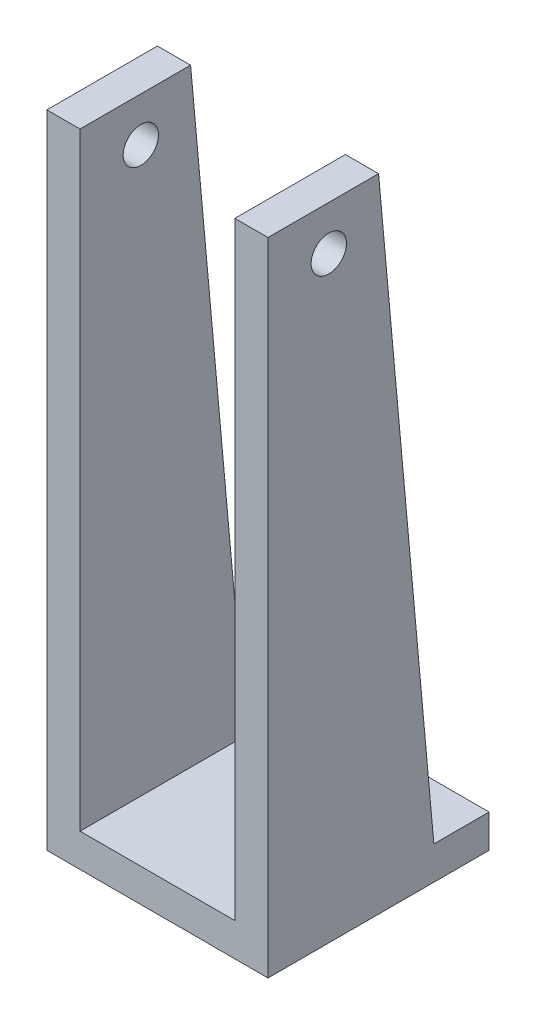
ISO-10303-21;
HEADER;
FILE_DESCRIPTION(('STEP AP214'),'2;1');
FILE_NAME('part.step','',(''),(''),'','','');
FILE_SCHEMA(('AUTOMOTIVE_DESIGN { 1 0 10303 214 1 1 1 1 }'));
ENDSEC;
DATA;
#1=APPLICATION_CONTEXT('core data for automotive mechanical design processes');
#2=APPLICATION_PROTOCOL_DEFINITION('international standard','automotive_design',2000,#1);
#3=PRODUCT_CONTEXT('',#1,'mechanical');
#4=PRODUCT('Part','Part','',(#3));
#5=PRODUCT_RELATED_PRODUCT_CATEGORY('part','',(#4));
#6=PRODUCT_DEFINITION_FORMATION('','',#4);
#7=PRODUCT_DEFINITION_CONTEXT('part definition',#1,'design');
#8=PRODUCT_DEFINITION('design','',#6,#7);
#9=PRODUCT_DEFINITION_SHAPE('','',#8);
#10=(LENGTH_UNIT() NAMED_UNIT(*) SI_UNIT(.MILLI.,.METRE.));
#11=(NAMED_UNIT(*) PLANE_ANGLE_UNIT() SI_UNIT($,.RADIAN.));
#12=(NAMED_UNIT(*) SI_UNIT($,.STERADIAN.) SOLID_ANGLE_UNIT());
#13=UNCERTAINTY_MEASURE_WITH_UNIT(LENGTH_MEASURE(1.E-05),#10,'distance_accuracy_value','');
#14=(GEOMETRIC_REPRESENTATION_CONTEXT(3) GLOBAL_UNCERTAINTY_ASSIGNED_CONTEXT((#13)) GLOBAL_UNIT_ASSIGNED_CONTEXT((#10,
#11,#12)) REPRESENTATION_CONTEXT('',''));
#15=CARTESIAN_POINT('',(0.,0.,0.));
#16=DIRECTION('',(0.,0.,1.));
#17=DIRECTION('',(1.,0.,0.));
#18=AXIS2_PLACEMENT_3D('',#15,#16,#17);
#19=CARTESIAN_POINT('',(-10.,3.,10.));
#20=DIRECTION('',(1.,0.,0.));
#21=DIRECTION('',(0.,0.,-1.));
#22=AXIS2_PLACEMENT_3D('',#19,#20,#21);
#23=PLANE('',#22);
#24=CARTESIAN_POINT('',(-10.,54.,4.5));
#25=DIRECTION('',(1.,0.,0.));
#26=DIRECTION('',(0.,0.,-1.));
#27=AXIS2_PLACEMENT_3D('',#24,#25,#26);
#28=CIRCLE('',#27,1.6);
#29=CARTESIAN_POINT('',(-10.,54.,2.9));
#30=VERTEX_POINT('',#29);
#31=EDGE_CURVE('E227',#30,#30,#28,.T.);
#32=ORIENTED_EDGE('',*,*,#31,.T.);
#33=EDGE_LOOP('',(#32));
#34=FACE_BOUND('',#33,.T.);
#35=DIRECTION('',(0.,0.,1.));
#36=VECTOR('',#35,1.);
#37=CARTESIAN_POINT('',(-10.,0.,10.));
#38=LINE('',#37,#36);
#39=CARTESIAN_POINT('',(-10.,0.,-10.));
#40=VERTEX_POINT('',#39);
#41=CARTESIAN_POINT('',(-10.,0.,10.));
#42=VERTEX_POINT('',#41);
#43=EDGE_CURVE('E166',#40,#42,#38,.T.);
#44=ORIENTED_EDGE('',*,*,#43,.T.);
#45=DIRECTION('',(0.,-1.,0.));
#46=VECTOR('',#45,1.);
#47=CARTESIAN_POINT('',(-10.,3.,10.));
#48=LINE('',#47,#46);
#49=CARTESIAN_POINT('',(-10.,58.,10.));
#50=VERTEX_POINT('',#49);
#51=EDGE_CURVE('E11',#50,#42,#48,.T.);
#52=ORIENTED_EDGE('',*,*,#51,.F.);
#53=DIRECTION('',(0.,0.,-1.));
#54=VECTOR('',#53,1.);
#55=CARTESIAN_POINT('',(-10.,58.,10.));
#56=LINE('',#55,#54);
#57=CARTESIAN_POINT('',(-10.,58.,0.));
#58=VERTEX_POINT('',#57);
#59=EDGE_CURVE('E145',#50,#58,#56,.T.);
#60=ORIENTED_EDGE('',*,*,#59,.T.);
#61=DIRECTION('',(0.,-0.995893206467704,-0.0905357460425185));
#62=VECTOR('',#61,1.);
#63=CARTESIAN_POINT('',(-10.,58.,0.));
#64=LINE('',#63,#62);
#65=CARTESIAN_POINT('',(-10.,3.,-5.));
#66=VERTEX_POINT('',#65);
#67=EDGE_CURVE('E150',#58,#66,#64,.T.);
#68=ORIENTED_EDGE('',*,*,#67,.T.);
#69=DIRECTION('',(0.,0.,1.));
#70=VECTOR('',#69,1.);
#71=CARTESIAN_POINT('',(-10.,3.,10.));
#72=LINE('',#71,#70);
#73=CARTESIAN_POINT('',(-10.,3.,-10.));
#74=VERTEX_POINT('',#73);
#75=EDGE_CURVE('E171',#74,#66,#72,.T.);
#76=ORIENTED_EDGE('',*,*,#75,.F.);
#77=DIRECTION('',(0.,-1.,0.));
#78=VECTOR('',#77,1.);
#79=CARTESIAN_POINT('',(-10.,3.,-10.));
#80=LINE('',#79,#78);
#81=EDGE_CURVE('E180',#74,#40,#80,.T.);
#82=ORIENTED_EDGE('',*,*,#81,.T.);
#83=EDGE_LOOP('',(#44,#52,#60,#68,#76,#82));
#84=FACE_BOUND('',#83,.T.);
#85=ADVANCED_FACE('F37',(#34,#84),#23,.F.);
#86=CARTESIAN_POINT('',(10.,3.,10.));
#87=DIRECTION('',(0.,0.,-1.));
#88=DIRECTION('',(-1.,0.,0.));
#89=AXIS2_PLACEMENT_3D('',#86,#87,#88);
#90=PLANE('',#89);
#91=DIRECTION('',(1.,0.,0.));
#92=VECTOR('',#91,1.);
#93=CARTESIAN_POINT('',(10.,0.,10.));
#94=LINE('',#93,#92);
#95=CARTESIAN_POINT('',(10.,0.,10.));
#96=VERTEX_POINT('',#95);
#97=EDGE_CURVE('E183',#42,#96,#94,.T.);
#98=ORIENTED_EDGE('',*,*,#97,.T.);
#99=DIRECTION('',(0.,-1.,0.));
#100=VECTOR('',#99,1.);
#101=CARTESIAN_POINT('',(10.,3.,10.));
#102=LINE('',#101,#100);
#103=CARTESIAN_POINT('',(10.,58.,10.));
#104=VERTEX_POINT('',#103);
#105=EDGE_CURVE('E45',#104,#96,#102,.T.);
#106=ORIENTED_EDGE('',*,*,#105,.F.);
#107=DIRECTION('',(1.,0.,0.));
#108=VECTOR('',#107,1.);
#109=CARTESIAN_POINT('',(7.,58.,10.));
#110=LINE('',#109,#108);
#111=CARTESIAN_POINT('',(7.,58.,10.));
#112=VERTEX_POINT('',#111);
#113=EDGE_CURVE('E125',#112,#104,#110,.T.);
#114=ORIENTED_EDGE('',*,*,#113,.F.);
#115=DIRECTION('',(0.,-1.,0.));
#116=VECTOR('',#115,1.);
#117=CARTESIAN_POINT('',(7.,58.,10.));
#118=LINE('',#117,#116);
#119=CARTESIAN_POINT('',(7.,3.,10.));
#120=VERTEX_POINT('',#119);
#121=EDGE_CURVE('E136',#112,#120,#118,.T.);
#122=ORIENTED_EDGE('',*,*,#121,.T.);
#123=DIRECTION('',(1.,0.,0.));
#124=VECTOR('',#123,1.);
#125=CARTESIAN_POINT('',(10.,3.,10.));
#126=LINE('',#125,#124);
#127=CARTESIAN_POINT('',(-7.,3.,10.));
#128=VERTEX_POINT('',#127);
#129=EDGE_CURVE('E57',#128,#120,#126,.T.);
#130=ORIENTED_EDGE('',*,*,#129,.F.);
#131=DIRECTION('',(0.,1.,0.));
#132=VECTOR('',#131,1.);
#133=CARTESIAN_POINT('',(-7.,3.,10.));
#134=LINE('',#133,#132);
#135=CARTESIAN_POINT('',(-7.,58.,10.));
#136=VERTEX_POINT('',#135);
#137=EDGE_CURVE('E149',#128,#136,#134,.T.);
#138=ORIENTED_EDGE('',*,*,#137,.T.);
#139=DIRECTION('',(-1.,0.,0.));
#140=VECTOR('',#139,1.);
#141=CARTESIAN_POINT('',(-7.,58.,10.));
#142=LINE('',#141,#140);
#143=EDGE_CURVE('E159',#136,#50,#142,.T.);
#144=ORIENTED_EDGE('',*,*,#143,.T.);
#145=ORIENTED_EDGE('',*,*,#51,.T.);
#146=EDGE_LOOP('',(#98,#106,#114,#122,#130,#138,#144,#145));
#147=FACE_BOUND('',#146,.T.);
#148=ADVANCED_FACE('F218',(#147),#90,.F.);
#149=CARTESIAN_POINT('',(10.,3.,10.));
#150=DIRECTION('',(-1.,0.,0.));
#151=DIRECTION('',(0.,0.,1.));
#152=AXIS2_PLACEMENT_3D('',#149,#150,#151);
#153=PLANE('',#152);
#154=CARTESIAN_POINT('',(10.,54.,4.5));
#155=DIRECTION('',(1.,0.,0.));
#156=DIRECTION('',(0.,0.,-1.));
#157=AXIS2_PLACEMENT_3D('',#154,#155,#156);
#158=CIRCLE('',#157,1.6);
#159=CARTESIAN_POINT('',(10.,54.,2.9));
#160=VERTEX_POINT('',#159);
#161=EDGE_CURVE('E224',#160,#160,#158,.T.);
#162=ORIENTED_EDGE('',*,*,#161,.F.);
#163=EDGE_LOOP('',(#162));
#164=FACE_BOUND('',#163,.T.);
#165=DIRECTION('',(0.,0.,-1.));
#166=VECTOR('',#165,1.);
#167=CARTESIAN_POINT('',(10.,0.,10.));
#168=LINE('',#167,#166);
#169=CARTESIAN_POINT('',(10.,0.,-10.));
#170=VERTEX_POINT('',#169);
#171=EDGE_CURVE('E185',#96,#170,#168,.T.);
#172=ORIENTED_EDGE('',*,*,#171,.T.);
#173=DIRECTION('',(0.,-1.,0.));
#174=VECTOR('',#173,1.);
#175=CARTESIAN_POINT('',(10.,3.,-10.));
#176=LINE('',#175,#174);
#177=CARTESIAN_POINT('',(10.,3.,-10.));
#178=VERTEX_POINT('',#177);
#179=EDGE_CURVE('E190',#178,#170,#176,.T.);
#180=ORIENTED_EDGE('',*,*,#179,.F.);
#181=DIRECTION('',(0.,0.,-1.));
#182=VECTOR('',#181,1.);
#183=CARTESIAN_POINT('',(10.,3.,10.));
#184=LINE('',#183,#182);
#185=CARTESIAN_POINT('',(10.,3.,-5.));
#186=VERTEX_POINT('',#185);
#187=EDGE_CURVE('E176',#186,#178,#184,.T.);
#188=ORIENTED_EDGE('',*,*,#187,.F.);
#189=DIRECTION('',(0.,0.995893206467704,0.0905357460425185));
#190=VECTOR('',#189,1.);
#191=CARTESIAN_POINT('',(10.,3.,-5.));
#192=LINE('',#191,#190);
#193=CARTESIAN_POINT('',(10.,58.,0.));
#194=VERTEX_POINT('',#193);
#195=EDGE_CURVE('E141',#186,#194,#192,.T.);
#196=ORIENTED_EDGE('',*,*,#195,.T.);
#197=DIRECTION('',(0.,0.,1.));
#198=VECTOR('',#197,1.);
#199=CARTESIAN_POINT('',(10.,58.,0.));
#200=LINE('',#199,#198);
#201=EDGE_CURVE('E121',#194,#104,#200,.T.);
#202=ORIENTED_EDGE('',*,*,#201,.T.);
#203=ORIENTED_EDGE('',*,*,#105,.T.);
#204=EDGE_LOOP('',(#172,#180,#188,#196,#202,#203));
#205=FACE_BOUND('',#204,.T.);
#206=ADVANCED_FACE('F196',(#164,#205),#153,.F.);
#207=CARTESIAN_POINT('',(10.,3.,-10.));
#208=DIRECTION('',(0.,0.,1.));
#209=DIRECTION('',(1.,0.,0.));
#210=AXIS2_PLACEMENT_3D('',#207,#208,#209);
#211=PLANE('',#210);
#212=DIRECTION('',(-1.,0.,0.));
#213=VECTOR('',#212,1.);
#214=CARTESIAN_POINT('',(10.,0.,-10.));
#215=LINE('',#214,#213);
#216=EDGE_CURVE('E174',#170,#40,#215,.T.);
#217=ORIENTED_EDGE('',*,*,#216,.T.);
#218=ORIENTED_EDGE('',*,*,#81,.F.);
#219=DIRECTION('',(-1.,0.,0.));
#220=VECTOR('',#219,1.);
#221=CARTESIAN_POINT('',(10.,3.,-10.));
#222=LINE('',#221,#220);
#223=EDGE_CURVE('E178',#178,#74,#222,.T.);
#224=ORIENTED_EDGE('',*,*,#223,.F.);
#225=ORIENTED_EDGE('',*,*,#179,.T.);
#226=EDGE_LOOP('',(#217,#218,#224,#225));
#227=FACE_BOUND('',#226,.T.);
#228=ADVANCED_FACE('F205',(#227),#211,.F.);
#229=CARTESIAN_POINT('',(0.,3.,0.));
#230=DIRECTION('',(0.,1.,0.));
#231=DIRECTION('',(0.,0.,1.));
#232=AXIS2_PLACEMENT_3D('',#229,#230,#231);
#233=PLANE('',#232);
#234=CARTESIAN_POINT('',(0.,3.,0.));
#235=DIRECTION('',(0.,1.,0.));
#236=DIRECTION('',(0.,0.,1.));
#237=AXIS2_PLACEMENT_3D('',#234,#235,#236);
#238=CIRCLE('',#237,2.);
#239=CARTESIAN_POINT('',(0.,3.,2.));
#240=VERTEX_POINT('',#239);
#241=EDGE_CURVE('E231',#240,#240,#238,.T.);
#242=ORIENTED_EDGE('',*,*,#241,.F.);
#243=EDGE_LOOP('',(#242));
#244=FACE_BOUND('',#243,.T.);
#245=DIRECTION('',(1.,0.,0.));
#246=VECTOR('',#245,1.);
#247=CARTESIAN_POINT('',(7.,3.,-5.));
#248=LINE('',#247,#246);
#249=CARTESIAN_POINT('',(7.,3.,-5.));
#250=VERTEX_POINT('',#249);
#251=EDGE_CURVE('E126',#250,#186,#248,.T.);
#252=ORIENTED_EDGE('',*,*,#251,.T.);
#253=ORIENTED_EDGE('',*,*,#187,.T.);
#254=ORIENTED_EDGE('',*,*,#223,.T.);
#255=ORIENTED_EDGE('',*,*,#75,.T.);
#256=DIRECTION('',(-1.,0.,0.));
#257=VECTOR('',#256,1.);
#258=CARTESIAN_POINT('',(-7.,3.,-5.));
#259=LINE('',#258,#257);
#260=CARTESIAN_POINT('',(-7.,3.,-5.));
#261=VERTEX_POINT('',#260);
#262=EDGE_CURVE('E164',#261,#66,#259,.T.);
#263=ORIENTED_EDGE('',*,*,#262,.F.);
#264=DIRECTION('',(0.,0.,1.));
#265=VECTOR('',#264,1.);
#266=CARTESIAN_POINT('',(-7.,3.,-5.));
#267=LINE('',#266,#265);
#268=EDGE_CURVE('E147',#261,#128,#267,.T.);
#269=ORIENTED_EDGE('',*,*,#268,.T.);
#270=ORIENTED_EDGE('',*,*,#129,.T.);
#271=DIRECTION('',(0.,0.,-1.));
#272=VECTOR('',#271,1.);
#273=CARTESIAN_POINT('',(7.,3.,10.));
#274=LINE('',#273,#272);
#275=EDGE_CURVE('E52',#120,#250,#274,.T.);
#276=ORIENTED_EDGE('',*,*,#275,.T.);
#277=EDGE_LOOP('',(#252,#253,#254,#255,#263,#269,#270,#276));
#278=FACE_BOUND('',#277,.T.);
#279=ADVANCED_FACE('F211',(#244,#278),#233,.T.);
#280=CARTESIAN_POINT('',(0.,0.,0.));
#281=DIRECTION('',(0.,1.,0.));
#282=DIRECTION('',(0.,0.,1.));
#283=AXIS2_PLACEMENT_3D('',#280,#281,#282);
#284=PLANE('',#283);
#285=CARTESIAN_POINT('',(0.,0.,0.));
#286=DIRECTION('',(0.,1.,0.));
#287=DIRECTION('',(0.,0.,1.));
#288=AXIS2_PLACEMENT_3D('',#285,#286,#287);
#289=CIRCLE('',#288,2.);
#290=CARTESIAN_POINT('',(0.,0.,2.));
#291=VERTEX_POINT('',#290);
#292=EDGE_CURVE('E228',#291,#291,#289,.T.);
#293=ORIENTED_EDGE('',*,*,#292,.T.);
#294=EDGE_LOOP('',(#293));
#295=FACE_BOUND('',#294,.T.);
#296=ORIENTED_EDGE('',*,*,#43,.F.);
#297=ORIENTED_EDGE('',*,*,#216,.F.);
#298=ORIENTED_EDGE('',*,*,#171,.F.);
#299=ORIENTED_EDGE('',*,*,#97,.F.);
#300=EDGE_LOOP('',(#296,#297,#298,#299));
#301=FACE_BOUND('',#300,.T.);
#302=ADVANCED_FACE('F202',(#295,#301),#284,.F.);
#303=CARTESIAN_POINT('',(-7.,58.,0.));
#304=DIRECTION('',(0.,0.0905357460425185,-0.995893206467704));
#305=DIRECTION('',(0.,0.995893206467704,0.0905357460425185));
#306=AXIS2_PLACEMENT_3D('',#303,#304,#305);
#307=PLANE('',#306);
#308=ORIENTED_EDGE('',*,*,#67,.F.);
#309=DIRECTION('',(-1.,0.,0.));
#310=VECTOR('',#309,1.);
#311=CARTESIAN_POINT('',(-7.,58.,0.));
#312=LINE('',#311,#310);
#313=CARTESIAN_POINT('',(-7.,58.,0.));
#314=VERTEX_POINT('',#313);
#315=EDGE_CURVE('E167',#314,#58,#312,.T.);
#316=ORIENTED_EDGE('',*,*,#315,.F.);
#317=DIRECTION('',(0.,-0.995893206467704,-0.0905357460425185));
#318=VECTOR('',#317,1.);
#319=CARTESIAN_POINT('',(-7.,58.,0.));
#320=LINE('',#319,#318);
#321=EDGE_CURVE('E156',#314,#261,#320,.T.);
#322=ORIENTED_EDGE('',*,*,#321,.T.);
#323=ORIENTED_EDGE('',*,*,#262,.T.);
#324=EDGE_LOOP('',(#308,#316,#322,#323));
#325=FACE_BOUND('',#324,.T.);
#326=ADVANCED_FACE('F213',(#325),#307,.T.);
#327=CARTESIAN_POINT('',(-7.,58.,10.));
#328=DIRECTION('',(0.,1.,0.));
#329=DIRECTION('',(0.,0.,1.));
#330=AXIS2_PLACEMENT_3D('',#327,#328,#329);
#331=PLANE('',#330);
#332=ORIENTED_EDGE('',*,*,#59,.F.);
#333=ORIENTED_EDGE('',*,*,#143,.F.);
#334=DIRECTION('',(0.,0.,-1.));
#335=VECTOR('',#334,1.);
#336=CARTESIAN_POINT('',(-7.,58.,10.));
#337=LINE('',#336,#335);
#338=EDGE_CURVE('E153',#136,#314,#337,.T.);
#339=ORIENTED_EDGE('',*,*,#338,.T.);
#340=ORIENTED_EDGE('',*,*,#315,.T.);
#341=EDGE_LOOP('',(#332,#333,#339,#340));
#342=FACE_BOUND('',#341,.T.);
#343=ADVANCED_FACE('F268',(#342),#331,.T.);
#344=CARTESIAN_POINT('',(-7.,0.,0.));
#345=DIRECTION('',(-1.,0.,0.));
#346=DIRECTION('',(0.,0.,1.));
#347=AXIS2_PLACEMENT_3D('',#344,#345,#346);
#348=PLANE('',#347);
#349=CARTESIAN_POINT('',(-7.,54.,4.5));
#350=DIRECTION('',(-1.,0.,0.));
#351=DIRECTION('',(0.,0.,1.));
#352=AXIS2_PLACEMENT_3D('',#349,#350,#351);
#353=CIRCLE('',#352,1.6);
#354=CARTESIAN_POINT('',(-7.,54.,6.1));
#355=VERTEX_POINT('',#354);
#356=EDGE_CURVE('E143',#355,#355,#353,.T.);
#357=ORIENTED_EDGE('',*,*,#356,.T.);
#358=EDGE_LOOP('',(#357));
#359=FACE_BOUND('',#358,.T.);
#360=ORIENTED_EDGE('',*,*,#268,.F.);
#361=ORIENTED_EDGE('',*,*,#321,.F.);
#362=ORIENTED_EDGE('',*,*,#338,.F.);
#363=ORIENTED_EDGE('',*,*,#137,.F.);
#364=EDGE_LOOP('',(#360,#361,#362,#363));
#365=FACE_BOUND('',#364,.T.);
#366=ADVANCED_FACE('F217',(#359,#365),#348,.F.);
#367=CARTESIAN_POINT('',(7.,58.,0.));
#368=DIRECTION('',(0.,1.,0.));
#369=DIRECTION('',(0.,0.,1.));
#370=AXIS2_PLACEMENT_3D('',#367,#368,#369);
#371=PLANE('',#370);
#372=ORIENTED_EDGE('',*,*,#201,.F.);
#373=DIRECTION('',(1.,0.,0.));
#374=VECTOR('',#373,1.);
#375=CARTESIAN_POINT('',(7.,58.,0.));
#376=LINE('',#375,#374);
#377=CARTESIAN_POINT('',(7.,58.,0.));
#378=VERTEX_POINT('',#377);
#379=EDGE_CURVE('E114',#378,#194,#376,.T.);
#380=ORIENTED_EDGE('',*,*,#379,.F.);
#381=DIRECTION('',(0.,0.,1.));
#382=VECTOR('',#381,1.);
#383=CARTESIAN_POINT('',(7.,58.,0.));
#384=LINE('',#383,#382);
#385=EDGE_CURVE('E119',#378,#112,#384,.T.);
#386=ORIENTED_EDGE('',*,*,#385,.T.);
#387=ORIENTED_EDGE('',*,*,#113,.T.);
#388=EDGE_LOOP('',(#372,#380,#386,#387));
#389=FACE_BOUND('',#388,.T.);
#390=ADVANCED_FACE('F116',(#389),#371,.T.);
#391=CARTESIAN_POINT('',(7.,3.,-5.));
#392=DIRECTION('',(0.,0.0905357460425185,-0.995893206467704));
#393=DIRECTION('',(0.,0.995893206467704,0.0905357460425185));
#394=AXIS2_PLACEMENT_3D('',#391,#392,#393);
#395=PLANE('',#394);
#396=ORIENTED_EDGE('',*,*,#195,.F.);
#397=ORIENTED_EDGE('',*,*,#251,.F.);
#398=DIRECTION('',(0.,0.995893206467704,0.0905357460425185));
#399=VECTOR('',#398,1.);
#400=CARTESIAN_POINT('',(7.,3.,-5.));
#401=LINE('',#400,#399);
#402=EDGE_CURVE('E129',#250,#378,#401,.T.);
#403=ORIENTED_EDGE('',*,*,#402,.T.);
#404=ORIENTED_EDGE('',*,*,#379,.T.);
#405=EDGE_LOOP('',(#396,#397,#403,#404));
#406=FACE_BOUND('',#405,.T.);
#407=ADVANCED_FACE('F130',(#406),#395,.T.);
#408=CARTESIAN_POINT('',(7.,0.,0.));
#409=DIRECTION('',(1.,0.,0.));
#410=DIRECTION('',(0.,0.,-1.));
#411=AXIS2_PLACEMENT_3D('',#408,#409,#410);
#412=PLANE('',#411);
#413=CARTESIAN_POINT('',(7.,54.,4.5));
#414=DIRECTION('',(1.,0.,0.));
#415=DIRECTION('',(0.,0.,-1.));
#416=AXIS2_PLACEMENT_3D('',#413,#414,#415);
#417=CIRCLE('',#416,1.6);
#418=CARTESIAN_POINT('',(7.,54.,2.9));
#419=VERTEX_POINT('',#418);
#420=EDGE_CURVE('E40',#419,#419,#417,.T.);
#421=ORIENTED_EDGE('',*,*,#420,.T.);
#422=EDGE_LOOP('',(#421));
#423=FACE_BOUND('',#422,.T.);
#424=ORIENTED_EDGE('',*,*,#121,.F.);
#425=ORIENTED_EDGE('',*,*,#385,.F.);
#426=ORIENTED_EDGE('',*,*,#402,.F.);
#427=ORIENTED_EDGE('',*,*,#275,.F.);
#428=EDGE_LOOP('',(#424,#425,#426,#427));
#429=FACE_BOUND('',#428,.T.);
#430=ADVANCED_FACE('F134',(#423,#429),#412,.F.);
#431=CARTESIAN_POINT('',(-10.,54.,4.5));
#432=DIRECTION('',(1.,0.,0.));
#433=DIRECTION('',(0.,0.,-1.));
#434=AXIS2_PLACEMENT_3D('',#431,#432,#433);
#435=CYLINDRICAL_SURFACE('',#434,1.6);
#436=ORIENTED_EDGE('',*,*,#161,.T.);
#437=EDGE_LOOP('',(#436));
#438=FACE_BOUND('',#437,.T.);
#439=ORIENTED_EDGE('',*,*,#420,.F.);
#440=EDGE_LOOP('',(#439));
#441=FACE_BOUND('',#440,.T.);
#442=ADVANCED_FACE('F263',(#438,#441),#435,.F.);
#443=ORIENTED_EDGE('',*,*,#31,.F.);
#444=EDGE_LOOP('',(#443));
#445=FACE_BOUND('',#444,.T.);
#446=ORIENTED_EDGE('',*,*,#356,.F.);
#447=EDGE_LOOP('',(#446));
#448=FACE_BOUND('',#447,.T.);
#449=ADVANCED_FACE('F241',(#445,#448),#435,.F.);
#450=CARTESIAN_POINT('',(0.,0.,0.));
#451=DIRECTION('',(0.,1.,0.));
#452=DIRECTION('',(0.,0.,1.));
#453=AXIS2_PLACEMENT_3D('',#450,#451,#452);
#454=CYLINDRICAL_SURFACE('',#453,2.);
#455=ORIENTED_EDGE('',*,*,#292,.F.);
#456=EDGE_LOOP('',(#455));
#457=FACE_BOUND('',#456,.T.);
#458=ORIENTED_EDGE('',*,*,#241,.T.);
#459=EDGE_LOOP('',(#458));
#460=FACE_BOUND('',#459,.T.);
#461=ADVANCED_FACE('F238',(#457,#460),#454,.F.);
#462=CLOSED_SHELL('',(#85,#148,#206,#228,#279,#302,#326,#343,#366,#390,#407,#430,#442,#449,#461));
#463=MANIFOLD_SOLID_BREP('B2',#462);
#464=ADVANCED_BREP_SHAPE_REPRESENTATION('',(#18,#463),#14);
#465=SHAPE_DEFINITION_REPRESENTATION(#9,#464);
ENDSEC;
END-ISO-10303-21;
